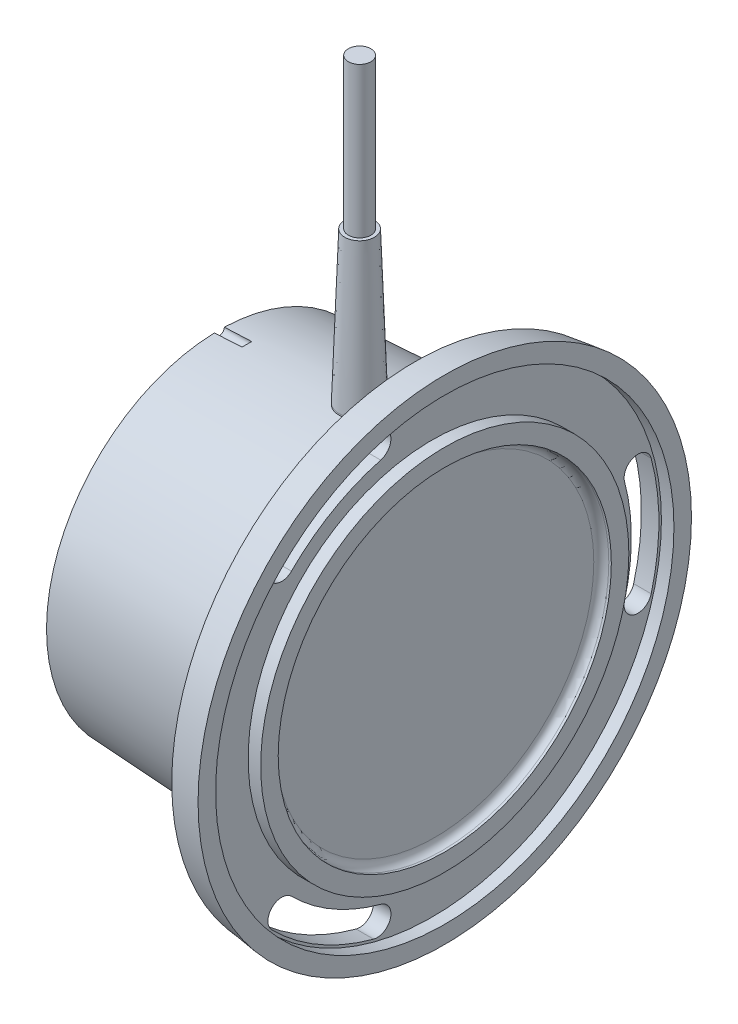
ISO-10303-21;
HEADER;
FILE_DESCRIPTION(('STEP AP214'),'2;1');
FILE_NAME('part.step','',(''),(''),'','','');
FILE_SCHEMA(('AUTOMOTIVE_DESIGN { 1 0 10303 214 1 1 1 1 }'));
ENDSEC;
DATA;
#1=APPLICATION_CONTEXT('core data for automotive mechanical design processes');
#2=APPLICATION_PROTOCOL_DEFINITION('international standard','automotive_design',2000,#1);
#3=PRODUCT_CONTEXT('',#1,'mechanical');
#4=PRODUCT('Part','Part','',(#3));
#5=PRODUCT_RELATED_PRODUCT_CATEGORY('part','',(#4));
#6=PRODUCT_DEFINITION_FORMATION('','',#4);
#7=PRODUCT_DEFINITION_CONTEXT('part definition',#1,'design');
#8=PRODUCT_DEFINITION('design','',#6,#7);
#9=PRODUCT_DEFINITION_SHAPE('','',#8);
#10=(LENGTH_UNIT() NAMED_UNIT(*) SI_UNIT(.MILLI.,.METRE.));
#11=(NAMED_UNIT(*) PLANE_ANGLE_UNIT() SI_UNIT($,.RADIAN.));
#12=(NAMED_UNIT(*) SI_UNIT($,.STERADIAN.) SOLID_ANGLE_UNIT());
#13=UNCERTAINTY_MEASURE_WITH_UNIT(LENGTH_MEASURE(1.E-05),#10,'distance_accuracy_value','');
#14=(GEOMETRIC_REPRESENTATION_CONTEXT(3) GLOBAL_UNCERTAINTY_ASSIGNED_CONTEXT((#13)) GLOBAL_UNIT_ASSIGNED_CONTEXT((#10,
#11,#12)) REPRESENTATION_CONTEXT('',''));
#15=CARTESIAN_POINT('',(0.,0.,0.));
#16=DIRECTION('',(0.,0.,1.));
#17=DIRECTION('',(1.,0.,0.));
#18=AXIS2_PLACEMENT_3D('',#15,#16,#17);
#19=CARTESIAN_POINT('',(28.,66.,0.));
#20=DIRECTION('',(0.,1.,0.));
#21=DIRECTION('',(0.,0.,1.));
#22=AXIS2_PLACEMENT_3D('',#19,#20,#21);
#23=PLANE('',#22);
#24=CARTESIAN_POINT('',(28.,66.,0.));
#25=DIRECTION('',(0.,1.,0.));
#26=DIRECTION('',(0.,0.,1.));
#27=AXIS2_PLACEMENT_3D('',#24,#25,#26);
#28=CIRCLE('',#27,2.95237691524758);
#29=CARTESIAN_POINT('',(28.,66.,2.95237691524758));
#30=VERTEX_POINT('',#29);
#31=EDGE_CURVE('E243',#30,#30,#28,.T.);
#32=ORIENTED_EDGE('',*,*,#31,.T.);
#33=EDGE_LOOP('',(#32));
#34=FACE_BOUND('',#33,.T.);
#35=CARTESIAN_POINT('',(28.,66.,0.));
#36=DIRECTION('',(0.,1.,0.));
#37=DIRECTION('',(0.,0.,1.));
#38=AXIS2_PLACEMENT_3D('',#35,#36,#37);
#39=CIRCLE('',#38,2.25);
#40=CARTESIAN_POINT('',(28.,66.,2.25));
#41=VERTEX_POINT('',#40);
#42=EDGE_CURVE('E237',#41,#41,#39,.T.);
#43=ORIENTED_EDGE('',*,*,#42,.F.);
#44=EDGE_LOOP('',(#43));
#45=FACE_BOUND('',#44,.T.);
#46=ADVANCED_FACE('F33',(#34,#45),#23,.T.);
#47=CARTESIAN_POINT('',(39.,0.,0.));
#48=DIRECTION('',(1.,0.,0.));
#49=DIRECTION('',(0.,0.,-1.));
#50=AXIS2_PLACEMENT_3D('',#47,#48,#49);
#51=CONICAL_SURFACE('',#50,36.5,0.0512371674034185);
#52=CARTESIAN_POINT('',(5.5002,34.7687218096424,-0.963217830515257));
#53=CARTESIAN_POINT('',(5.16734204294178,34.7515126146158,-0.968017715513699));
#54=CARTESIAN_POINT('',(4.83447649524155,34.7343156956424,-0.972319788754847));
#55=CARTESIAN_POINT('',(4.16873657126538,34.6999467406474,-0.979965061656519));
#56=CARTESIAN_POINT('',(3.83586219511793,34.6827747043679,-0.983308271328277));
#57=CARTESIAN_POINT('',(2.91914405483441,34.6355187324375,-0.991245575102052));
#58=CARTESIAN_POINT('',(2.33529050478183,34.6054605980492,-0.994882519406034));
#59=CARTESIAN_POINT('',(1.16755803085788,34.5454209802628,-0.999418047066386));
#60=CARTESIAN_POINT('',(0.583679106717657,34.5154394982784,-1.00031658027601));
#61=CARTESIAN_POINT('',(-0.000199999999913171,34.4854969899679,-0.999894825827186));
#62=B_SPLINE_CURVE_WITH_KNOTS('',3,(#52,#53,#54,#55,#56,#57,#58,#59,#60,#61),.UNSPECIFIED.,.F.,
.F.,(4,2,2,2,4),(0.,1.00001051321694,2.00001058521581,3.75391796812255,5.50785746900228),.UNSPECIFIED.);
#63=CARTESIAN_POINT('',(5.5,34.7687114693804,-0.963220715217156));
#64=VERTEX_POINT('',#63);
#65=CARTESIAN_POINT('',(0.,34.4855072463768,-0.999894974531004));
#66=VERTEX_POINT('',#65);
#67=EDGE_CURVE('E288',#64,#66,#62,.T.);
#68=ORIENTED_EDGE('',*,*,#67,.F.);
#69=CARTESIAN_POINT('',(5.5,0.,0.));
#70=DIRECTION('',(-1.,0.,0.));
#71=DIRECTION('',(0.,0.,1.));
#72=AXIS2_PLACEMENT_3D('',#69,#70,#71);
#73=CIRCLE('',#72,34.7820512820513);
#74=CARTESIAN_POINT('',(5.5,34.7687114693804,0.963220715217156));
#75=VERTEX_POINT('',#74);
#76=EDGE_CURVE('E46',#64,#75,#73,.F.);
#77=ORIENTED_EDGE('',*,*,#76,.T.);
#78=CARTESIAN_POINT('',(-0.000199999999993919,34.4854969899681,0.999894825819203));
#79=CARTESIAN_POINT('',(0.332699120070851,34.502568734654,1.00014192571287));
#80=CARTESIAN_POINT('',(0.665597790263742,34.5196531278215,0.999953259180684));
#81=CARTESIAN_POINT('',(1.33138877954517,34.5538469306266,0.998695719859313));
#82=CARTESIAN_POINT('',(1.66428109866387,34.5709563400077,0.997626856036208));
#83=CARTESIAN_POINT('',(2.58102964638199,34.6181086514903,0.993459361506711));
#84=CARTESIAN_POINT('',(3.16488066336798,34.6481775930621,0.989437990409768));
#85=CARTESIAN_POINT('',(4.33256219321329,34.7083923676219,0.978519800053021));
#86=CARTESIAN_POINT('',(4.91639270551966,34.7385382019746,0.971622929403483));
#87=CARTESIAN_POINT('',(5.5002,34.7687218096424,0.963217830515254));
#88=B_SPLINE_CURVE_WITH_KNOTS('',3,(#78,#79,#80,#81,#82,#83,#84,#85,#86,#87),.UNSPECIFIED.,.F.,
.F.,(4,2,2,2,4),(0.,1.00000943601882,2.00000868562691,3.75391729126552,5.50785724337385),.UNSPECIFIED.);
#89=CARTESIAN_POINT('',(0.,34.4855072463768,0.999894974531034));
#90=VERTEX_POINT('',#89);
#91=EDGE_CURVE('E282',#90,#75,#88,.T.);
#92=ORIENTED_EDGE('',*,*,#91,.F.);
#93=CARTESIAN_POINT('',(0.,0.,0.));
#94=DIRECTION('',(1.,0.,0.));
#95=DIRECTION('',(0.,0.,-1.));
#96=AXIS2_PLACEMENT_3D('',#93,#94,#95);
#97=CIRCLE('',#96,34.5);
#98=EDGE_CURVE('E293',#90,#66,#97,.T.);
#99=ORIENTED_EDGE('',*,*,#98,.T.);
#100=EDGE_LOOP('',(#68,#77,#92,#99));
#101=FACE_BOUND('',#100,.T.);
#102=CARTESIAN_POINT('',(39.,0.,0.));
#103=DIRECTION('',(1.,0.,0.));
#104=DIRECTION('',(0.,0.,-1.));
#105=AXIS2_PLACEMENT_3D('',#102,#103,#104);
#106=CIRCLE('',#105,36.5);
#107=CARTESIAN_POINT('',(39.,0.,-36.5));
#108=VERTEX_POINT('',#107);
#109=EDGE_CURVE('E297',#108,#108,#106,.T.);
#110=ORIENTED_EDGE('',*,*,#109,.F.);
#111=EDGE_LOOP('',(#110));
#112=FACE_BOUND('',#111,.T.);
#113=CARTESIAN_POINT('',(31.0558347950813,36.0002,2.58106057758639));
#114=CARTESIAN_POINT('',(30.9829624943268,35.9902672727489,2.66735260975896));
#115=CARTESIAN_POINT('',(30.9064405762152,35.9800556261139,2.7505215776685));
#116=CARTESIAN_POINT('',(30.7466719839248,35.9592823706909,2.910071888084));
#117=CARTESIAN_POINT('',(30.6634256711525,35.9487207807288,2.98645359491243));
#118=CARTESIAN_POINT('',(30.4908161686985,35.9274594971849,3.13186243648485));
#119=CARTESIAN_POINT('',(30.4014559281775,35.9167598721799,3.20089307663373));
#120=CARTESIAN_POINT('',(30.2172476885548,35.895425998792,3.33114924567909));
#121=CARTESIAN_POINT('',(30.1223997353143,35.8847917498635,3.39237483978921));
#122=CARTESIAN_POINT('',(29.8304853118112,35.8532779428769,3.56372436006317));
#123=CARTESIAN_POINT('',(29.6259738162335,35.8327779406242,3.66158364646448));
#124=CARTESIAN_POINT('',(29.2033293180839,35.7942910934065,3.82139996580729));
#125=CARTESIAN_POINT('',(28.9851998366279,35.7763036026596,3.88336623713577));
#126=CARTESIAN_POINT('',(28.5418974580251,35.7439732599101,3.96952968569834));
#127=CARTESIAN_POINT('',(28.3167443641397,35.7296210465707,3.99382471614747));
#128=CARTESIAN_POINT('',(27.8653088853739,35.7051752926775,4.0041035541207));
#129=CARTESIAN_POINT('',(27.6390263832743,35.6950822038786,3.99008329881642));
#130=CARTESIAN_POINT('',(27.1937070398581,35.6793986955458,3.92430183233382));
#131=CARTESIAN_POINT('',(26.9746267800652,35.6737729780478,3.87284276895653));
#132=CARTESIAN_POINT('',(26.5481313138362,35.6665862830101,3.73394844278099));
#133=CARTESIAN_POINT('',(26.3407152502303,35.6650250064028,3.64651582751784));
#134=CARTESIAN_POINT('',(25.9439509097445,35.6652452000315,3.43841852313303));
#135=CARTESIAN_POINT('',(25.7545590965082,35.6670183890871,3.31783679507882));
#136=CARTESIAN_POINT('',(25.3985907365055,35.672873978875,3.04675615804891));
#137=CARTESIAN_POINT('',(25.2320151157084,35.6769564732933,2.89625603547623));
#138=CARTESIAN_POINT('',(24.9258260511951,35.6862707526889,2.56901438307853));
#139=CARTESIAN_POINT('',(24.7863065502207,35.6915064118599,2.39218506197219));
#140=CARTESIAN_POINT('',(24.5388637024899,35.7019256205789,2.01765029149755));
#141=CARTESIAN_POINT('',(24.4309405336767,35.7071091698332,1.81994472456764));
#142=CARTESIAN_POINT('',(24.2495302789318,35.7163858390452,1.4087535776262));
#143=CARTESIAN_POINT('',(24.1761220668189,35.7204764523041,1.19523313276974));
#144=CARTESIAN_POINT('',(24.0662056397882,35.7267714097324,0.758870392723562));
#145=CARTESIAN_POINT('',(24.0296970657189,35.7289757722609,0.536028188286388));
#146=CARTESIAN_POINT('',(23.9946525520598,35.7310896328418,0.0876713175695218));
#147=CARTESIAN_POINT('',(23.9960651757178,35.7310022394622,-0.137839313980054));
#148=CARTESIAN_POINT('',(24.0366954731665,35.7285562570481,-0.585415220768946));
#149=CARTESIAN_POINT('',(24.0759130712265,35.7261976725632,-0.807480502909052));
#150=CARTESIAN_POINT('',(24.1909846395374,35.7196470954983,-1.24169713964061));
#151=CARTESIAN_POINT('',(24.2668111367126,35.7154564779863,-1.45385579790871));
#152=CARTESIAN_POINT('',(24.4529332365279,35.7060406346837,-1.86244907484916));
#153=CARTESIAN_POINT('',(24.563229324947,35.7008153943125,-2.05888347187091));
#154=CARTESIAN_POINT('',(24.8153872866784,35.690385831593,-2.43080272662581));
#155=CARTESIAN_POINT('',(24.9573011307726,35.6851815582146,-2.60625235301742));
#156=CARTESIAN_POINT('',(25.2685859414863,35.6760073363757,-2.93086060390249));
#157=CARTESIAN_POINT('',(25.4379569820889,35.6720373912412,-3.08001915755263));
#158=CARTESIAN_POINT('',(25.7993482623273,35.6665199941907,-3.34779063006853));
#159=CARTESIAN_POINT('',(25.9913663893216,35.6649723165046,-3.46640639484847));
#160=CARTESIAN_POINT('',(26.3925873816561,35.6653123702629,-3.66971367629691));
#161=CARTESIAN_POINT('',(26.6017896615073,35.6671999847083,-3.75440634819688));
#162=CARTESIAN_POINT('',(27.0305848989475,35.675090549797,-3.8872132736247));
#163=CARTESIAN_POINT('',(27.2501370754722,35.6810784307606,-3.93546011519584));
#164=CARTESIAN_POINT('',(27.6940504208894,35.6974175169125,-3.9945625806928));
#165=CARTESIAN_POINT('',(27.918411434052,35.7077685810053,-4.00541941362367));
#166=CARTESIAN_POINT('',(28.3652462752639,35.7326019704785,-3.98955015371189));
#167=CARTESIAN_POINT('',(28.5877222960208,35.7470785234974,-3.96287636960757));
#168=CARTESIAN_POINT('',(29.0249260272648,35.7794896486706,-3.87289834543561));
#169=CARTESIAN_POINT('',(29.2396520371211,35.7974249743926,-3.80958611687266));
#170=CARTESIAN_POINT('',(29.6566794888091,35.8357789385847,-3.64771004631082));
#171=CARTESIAN_POINT('',(29.8588938676461,35.8562125497036,-3.54892602704241));
#172=CARTESIAN_POINT('',(30.2437568256566,35.8980448599929,-3.31898904684544));
#173=CARTESIAN_POINT('',(30.4264239215302,35.9194426180418,-3.18786711514713));
#174=CARTESIAN_POINT('',(30.6794195624874,35.9507401680791,-2.97196484494406));
#175=CARTESIAN_POINT('',(30.7592031335042,35.9608929454702,-2.89803854800496));
#176=CARTESIAN_POINT('',(30.9123713260509,35.9808478437074,-2.7440570949395));
#177=CARTESIAN_POINT('',(30.9857673404295,35.9906505696851,-2.66401334976948));
#178=CARTESIAN_POINT('',(31.0558347950813,36.0002,-2.58106057758639));
#179=B_SPLINE_CURVE_WITH_KNOTS('',3,(#113,#114,#115,#116,#117,#118,#119,#120,#121,#122,#123,
#124,#125,#126,#127,#128,#129,#130,#131,#132,#133,#134,#135,#136,#137,#138,#139,#140,#141,#142,
#143,#144,#145,#146,#147,#148,#149,#150,#151,#152,#153,#154,#155,#156,#157,#158,#159,#160,#161,
#162,#163,#164,#165,#166,#167,#168,#169,#170,#171,#172,#173,#174,#175,#176,#177,#178),
.UNSPECIFIED.,.F.,.F.,(4,2,2,2,2,2,2,2,2,2,2,2,2,2,2,2,2,2,2,2,2,2,2,2,2,2,2,2,2,2,2,2,4),(0.,
0.34003162992082,0.680044996791593,1.01989549305935,1.3597431495825,2.03914891379344,
2.71837973015977,3.39584323203881,4.07337857273288,4.74550571518656,5.41758340013887,
6.08799417714353,6.75843215395555,7.43115786944948,8.10388737350456,8.77814682022477,
9.45239970417913,10.1257380699741,10.7990750869457,11.4719075830749,12.1447495618427,
12.8187057736358,13.4926638014278,14.1665590084555,14.8404312644169,15.5118400424954,
16.183227110383,16.8536793510486,17.5242778294623,18.1991128535441,18.8733028547369,
19.2007174693075,19.527535597753),.UNSPECIFIED.);
#180=CARTESIAN_POINT('',(31.0543672008937,36.,2.58279712755467));
#181=VERTEX_POINT('',#180);
#182=CARTESIAN_POINT('',(31.0543672008937,36.,-2.58279712755466));
#183=VERTEX_POINT('',#182);
#184=EDGE_CURVE('E11',#181,#183,#179,.T.);
#185=ORIENTED_EDGE('',*,*,#184,.T.);
#186=CARTESIAN_POINT('',(27.9833998795208,35.7105987931147,-4.01007175399731));
#187=CARTESIAN_POINT('',(28.0953593322982,35.7163417419881,-4.01034557312574));
#188=CARTESIAN_POINT('',(28.2072956218739,35.722622268723,-4.00589007800906));
#189=CARTESIAN_POINT('',(28.4303336115921,35.7361774512189,-3.98761805200315));
#190=CARTESIAN_POINT('',(28.5414353689007,35.7434520382186,-3.97380216833122));
#191=CARTESIAN_POINT('',(28.7621470447583,35.7589232142632,-3.93688768197473));
#192=CARTESIAN_POINT('',(28.8717552821482,35.7671207593093,-3.91377938931086));
#193=CARTESIAN_POINT('',(29.0885606636984,35.7843108853839,-3.85848131127856));
#194=CARTESIAN_POINT('',(29.1957578643721,35.7933034477531,-3.82629173901005));
#195=CARTESIAN_POINT('',(29.5151031773822,35.8214937984661,-3.71556629622748));
#196=CARTESIAN_POINT('',(29.7225624403276,35.8417299633842,-3.62328309256945));
#197=CARTESIAN_POINT('',(30.1183253893453,35.8834780301455,-3.40531621497951));
#198=CARTESIAN_POINT('',(30.3066746038733,35.9049866968961,-3.27971463234956));
#199=CARTESIAN_POINT('',(30.550579986323,35.9345126858434,-3.08550409181725));
#200=CARTESIAN_POINT('',(30.6164235052219,35.9426734586635,-3.02949021546776));
#201=CARTESIAN_POINT('',(30.7443732509471,35.9588600471778,-2.9133110074604));
#202=CARTESIAN_POINT('',(30.806478928548,35.9668858429146,-2.85314506848749));
#203=CARTESIAN_POINT('',(31.0225529190029,35.9953280284748,-2.62977390600937));
#204=CARTESIAN_POINT('',(31.1651672955805,36.0151049535421,-2.45518132277018));
#205=CARTESIAN_POINT('',(31.4194607878007,36.0515436737909,-2.08414022516438));
#206=CARTESIAN_POINT('',(31.5310822749109,36.0681996473952,-1.8876519354056));
#207=CARTESIAN_POINT('',(31.7199037465517,36.0969762980213,-1.47849510199219));
#208=CARTESIAN_POINT('',(31.7971143010317,36.1090983675307,-1.26583155039554));
#209=CARTESIAN_POINT('',(31.9147828663527,36.1277684496505,-0.830442611039278));
#210=CARTESIAN_POINT('',(31.9552586501584,36.1343191576925,-0.607722143815681));
#211=CARTESIAN_POINT('',(31.9981272247984,36.1412617648936,-0.16024441226727));
#212=CARTESIAN_POINT('',(32.0008041002316,36.1416996061383,0.0644849419335279));
#213=CARTESIAN_POINT('',(31.9687125848401,36.1364955084141,0.511242061171622));
#214=CARTESIAN_POINT('',(31.933935264284,36.1308521195739,0.733269169180551));
#215=CARTESIAN_POINT('',(31.8281865794448,36.11400123295,1.16744924563032));
#216=CARTESIAN_POINT('',(31.7573416441814,36.1028131746953,1.37963389925846));
#217=CARTESIAN_POINT('',(31.5816049320715,36.0758210941605,1.78897675305125));
#218=CARTESIAN_POINT('',(31.4767415814421,36.0600209269177,1.98614732990756));
#219=CARTESIAN_POINT('',(31.2851446796524,36.0322283828409,2.28391600427189));
#220=CARTESIAN_POINT('',(31.2083789655692,36.0213003064571,2.39118065140094));
#221=CARTESIAN_POINT('',(31.044791062201,35.9985998299687,2.59748113137976));
#222=CARTESIAN_POINT('',(30.9579846030626,35.9868287612532,2.69652942910811));
#223=CARTESIAN_POINT('',(30.8552850195916,35.9733102751546,2.80268989488496));
#224=CARTESIAN_POINT('',(30.8438974364009,35.9718165978068,2.81431833163313));
#225=CARTESIAN_POINT('',(30.7533387548289,35.959981387428,2.90567114175496));
#226=CARTESIAN_POINT('',(30.6708540912116,35.9494597531091,2.98216037740806));
#227=CARTESIAN_POINT('',(30.4997181627153,35.9282585005333,3.12795611742919));
#228=CARTESIAN_POINT('',(30.4110626214788,35.9175787768396,3.19725755621997));
#229=CARTESIAN_POINT('',(30.2279433349405,35.896236574523,3.3283606891612));
#230=CARTESIAN_POINT('',(30.1334626473711,35.8855742486596,3.39013878623833));
#231=CARTESIAN_POINT('',(29.9395996722736,35.8644995245834,3.50550341518781));
#232=CARTESIAN_POINT('',(29.8402173171037,35.8540871298225,3.55908983397511));
#233=CARTESIAN_POINT('',(29.6369377729765,35.8336695214189,3.65783277381456));
#234=CARTESIAN_POINT('',(29.5330279893266,35.8236656163996,3.70296364649488));
#235=CARTESIAN_POINT('',(29.3216974973321,35.8042706022348,3.78426516425104));
#236=CARTESIAN_POINT('',(29.2142765882966,35.7948795282102,3.820435296126));
#237=CARTESIAN_POINT('',(28.9969139009702,35.776884053955,3.88346825080975));
#238=CARTESIAN_POINT('',(28.8869777566887,35.768278076773,3.91035004733506));
#239=CARTESIAN_POINT('',(28.6651563340408,35.7519534316611,3.95471337374277));
#240=CARTESIAN_POINT('',(28.5532709809385,35.74423479784,3.97219454236664));
#241=CARTESIAN_POINT('',(28.4408073115007,35.737021322801,3.98487648383626));
#242=B_SPLINE_CURVE_WITH_KNOTS('',3,(#186,#187,#188,#189,#190,#191,#192,#193,#194,#195,#196,
#197,#198,#199,#200,#201,#202,#203,#204,#205,#206,#207,#208,#209,#210,#211,#212,#213,#214,#215,
#216,#217,#218,#219,#220,#221,#222,#223,#224,#225,#226,#227,#228,#229,#230,#231,#232,#233,#234,
#235,#236,#237,#238,#239,#240,#241),.UNSPECIFIED.,.F.,.F.,(4,2,2,2,2,2,2,2,2,2,2,2,2,2,2,2,2,2,
2,2,2,2,2,2,2,2,2,4),(0.,0.336208997956096,0.672394751356191,1.00893198690024,1.34546132596945,
2.02587329334808,2.70462415629729,2.96497117405067,3.22535635335817,3.90075290128563,
4.57739700515867,5.25383312188312,5.92994179150871,6.60096631494232,7.27215085771425,
7.94099870970565,8.60928909743015,9.00582244728399,9.40174278134973,9.45077628912493,
9.78926013305689,10.1279809242984,10.46773815601,10.807500077602,11.1482764859738,
11.4890724068331,11.8291679941681,12.1692766501681),.UNSPECIFIED.);
#243=EDGE_CURVE('E246',#183,#181,#242,.T.);
#244=ORIENTED_EDGE('',*,*,#243,.T.);
#245=EDGE_LOOP('',(#185,#244));
#246=FACE_BOUND('',#245,.T.);
#247=ADVANCED_FACE('F255',(#101,#112,#246),#51,.T.);
#248=CARTESIAN_POINT('',(43.,31.75,0.));
#249=DIRECTION('',(1.,0.,0.));
#250=DIRECTION('',(0.,0.,-1.));
#251=AXIS2_PLACEMENT_3D('',#248,#249,#250);
#252=PLANE('',#251);
#253=CARTESIAN_POINT('',(43.,0.,0.));
#254=DIRECTION('',(1.,0.,0.));
#255=DIRECTION('',(0.,0.,-1.));
#256=AXIS2_PLACEMENT_3D('',#253,#254,#255);
#257=CIRCLE('',#256,31.75);
#258=CARTESIAN_POINT('',(43.,0.,-31.75));
#259=VERTEX_POINT('',#258);
#260=EDGE_CURVE('E324',#259,#259,#257,.T.);
#261=ORIENTED_EDGE('',*,*,#260,.T.);
#262=EDGE_LOOP('',(#261));
#263=FACE_BOUND('',#262,.T.);
#264=ADVANCED_FACE('F35',(#263),#252,.T.);
#265=CARTESIAN_POINT('',(44.5,0.,0.));
#266=DIRECTION('',(1.,0.,0.));
#267=DIRECTION('',(0.,0.,-1.));
#268=AXIS2_PLACEMENT_3D('',#265,#266,#267);
#269=TOROIDAL_SURFACE('',#268,31.75,1.5);
#270=CARTESIAN_POINT('',(44.5,0.,0.));
#271=DIRECTION('',(1.,0.,0.));
#272=DIRECTION('',(0.,0.,-1.));
#273=AXIS2_PLACEMENT_3D('',#270,#271,#272);
#274=CIRCLE('',#273,33.25);
#275=CARTESIAN_POINT('',(44.5,0.,-33.25));
#276=VERTEX_POINT('',#275);
#277=EDGE_CURVE('E321',#276,#276,#274,.T.);
#278=ORIENTED_EDGE('',*,*,#277,.T.);
#279=EDGE_LOOP('',(#278));
#280=FACE_BOUND('',#279,.T.);
#281=ORIENTED_EDGE('',*,*,#260,.F.);
#282=EDGE_LOOP('',(#281));
#283=FACE_BOUND('',#282,.T.);
#284=ADVANCED_FACE('F347',(#280,#283),#269,.F.);
#285=CARTESIAN_POINT('',(104.922362869198,0.,0.));
#286=DIRECTION('',(1.,0.,0.));
#287=DIRECTION('',(0.,0.,-1.));
#288=AXIS2_PLACEMENT_3D('',#285,#286,#287);
#289=CYLINDRICAL_SURFACE('',#288,33.25);
#290=CARTESIAN_POINT('',(45.,0.,0.));
#291=DIRECTION('',(1.,0.,0.));
#292=DIRECTION('',(0.,0.,-1.));
#293=AXIS2_PLACEMENT_3D('',#290,#291,#292);
#294=CIRCLE('',#293,33.25);
#295=CARTESIAN_POINT('',(45.,0.,-33.25));
#296=VERTEX_POINT('',#295);
#297=EDGE_CURVE('E318',#296,#296,#294,.T.);
#298=ORIENTED_EDGE('',*,*,#297,.T.);
#299=EDGE_LOOP('',(#298));
#300=FACE_BOUND('',#299,.T.);
#301=ORIENTED_EDGE('',*,*,#277,.F.);
#302=EDGE_LOOP('',(#301));
#303=FACE_BOUND('',#302,.T.);
#304=ADVANCED_FACE('F440',(#300,#303),#289,.F.);
#305=CARTESIAN_POINT('',(45.,36.75,0.));
#306=DIRECTION('',(1.,0.,0.));
#307=DIRECTION('',(0.,0.,-1.));
#308=AXIS2_PLACEMENT_3D('',#305,#306,#307);
#309=PLANE('',#308);
#310=CARTESIAN_POINT('',(45.,0.,0.));
#311=DIRECTION('',(1.,0.,0.));
#312=DIRECTION('',(0.,0.,-1.));
#313=AXIS2_PLACEMENT_3D('',#310,#311,#312);
#314=CIRCLE('',#313,36.75);
#315=CARTESIAN_POINT('',(45.,0.,-36.75));
#316=VERTEX_POINT('',#315);
#317=EDGE_CURVE('E315',#316,#316,#314,.T.);
#318=ORIENTED_EDGE('',*,*,#317,.T.);
#319=EDGE_LOOP('',(#318));
#320=FACE_BOUND('',#319,.T.);
#321=ORIENTED_EDGE('',*,*,#297,.F.);
#322=EDGE_LOOP('',(#321));
#323=FACE_BOUND('',#322,.T.);
#324=ADVANCED_FACE('F434',(#320,#323),#309,.T.);
#325=CARTESIAN_POINT('',(104.922362869198,0.,0.));
#326=DIRECTION('',(1.,0.,0.));
#327=DIRECTION('',(0.,0.,-1.));
#328=AXIS2_PLACEMENT_3D('',#325,#326,#327);
#329=CYLINDRICAL_SURFACE('',#328,36.75);
#330=CARTESIAN_POINT('',(42.5,0.,0.));
#331=DIRECTION('',(1.,0.,0.));
#332=DIRECTION('',(0.,0.,-1.));
#333=AXIS2_PLACEMENT_3D('',#330,#331,#332);
#334=CIRCLE('',#333,36.75);
#335=CARTESIAN_POINT('',(42.5,0.,-36.75));
#336=VERTEX_POINT('',#335);
#337=EDGE_CURVE('E312',#336,#336,#334,.T.);
#338=ORIENTED_EDGE('',*,*,#337,.T.);
#339=EDGE_LOOP('',(#338));
#340=FACE_BOUND('',#339,.T.);
#341=ORIENTED_EDGE('',*,*,#317,.F.);
#342=EDGE_LOOP('',(#341));
#343=FACE_BOUND('',#342,.T.);
#344=ADVANCED_FACE('F418',(#340,#343),#329,.T.);
#345=CARTESIAN_POINT('',(42.5,45.75,0.));
#346=DIRECTION('',(1.,0.,0.));
#347=DIRECTION('',(0.,0.,-1.));
#348=AXIS2_PLACEMENT_3D('',#345,#346,#347);
#349=PLANE('',#348);
#350=CARTESIAN_POINT('',(42.5,0.,0.));
#351=DIRECTION('',(1.,0.,0.));
#352=DIRECTION('',(0.,0.,-1.));
#353=AXIS2_PLACEMENT_3D('',#350,#351,#352);
#354=CIRCLE('',#353,45.25);
#355=CARTESIAN_POINT('',(42.5,43.7081980100518,11.711358875643));
#356=VERTEX_POINT('',#355);
#357=CARTESIAN_POINT('',(42.5,31.9964333041697,31.9967303925233));
#358=VERTEX_POINT('',#357);
#359=EDGE_CURVE('E177',#356,#358,#354,.T.);
#360=ORIENTED_EDGE('',*,*,#359,.F.);
#361=CARTESIAN_POINT('',(42.5,41.0518986834741,10.9996188334768));
#362=DIRECTION('',(1.,0.,0.));
#363=DIRECTION('',(0.,0.,-1.));
#364=AXIS2_PLACEMENT_3D('',#361,#362,#363);
#365=CIRCLE('',#364,2.74999999999999);
#366=CARTESIAN_POINT('',(42.5,38.3955993568964,10.2878787913107));
#367=VERTEX_POINT('',#366);
#368=EDGE_CURVE('E170',#367,#356,#365,.T.);
#369=ORIENTED_EDGE('',*,*,#368,.F.);
#370=CARTESIAN_POINT('',(42.5,0.,0.));
#371=DIRECTION('',(1.,0.,0.));
#372=DIRECTION('',(0.,0.,-1.));
#373=AXIS2_PLACEMENT_3D('',#370,#371,#372);
#374=CIRCLE('',#373,39.75);
#375=CARTESIAN_POINT('',(42.5,28.1073640627789,28.1076250409459));
#376=VERTEX_POINT('',#375);
#377=EDGE_CURVE('E150',#376,#367,#374,.F.);
#378=ORIENTED_EDGE('',*,*,#377,.F.);
#379=CARTESIAN_POINT('',(42.5,30.0518986834743,30.0521777167346));
#380=DIRECTION('',(1.,0.,0.));
#381=DIRECTION('',(0.,0.,-1.));
#382=AXIS2_PLACEMENT_3D('',#379,#380,#381);
#383=CIRCLE('',#382,2.74999999999999);
#384=EDGE_CURVE('E175',#358,#376,#383,.T.);
#385=ORIENTED_EDGE('',*,*,#384,.F.);
#386=EDGE_LOOP('',(#360,#369,#378,#385));
#387=FACE_BOUND('',#386,.T.);
#388=CARTESIAN_POINT('',(42.5,0.,0.));
#389=DIRECTION('',(1.,0.,0.));
#390=DIRECTION('',(0.,0.,-1.));
#391=AXIS2_PLACEMENT_3D('',#388,#389,#390);
#392=CIRCLE('',#391,45.25);
#393=CARTESIAN_POINT('',(42.5,-31.9964333041692,31.9967303925237));
#394=VERTEX_POINT('',#393);
#395=CARTESIAN_POINT('',(42.5,-43.7081980100517,11.7113588756436));
#396=VERTEX_POINT('',#395);
#397=EDGE_CURVE('E206',#394,#396,#392,.T.);
#398=ORIENTED_EDGE('',*,*,#397,.F.);
#399=CARTESIAN_POINT('',(42.5,-30.0518986834739,30.052177716735));
#400=DIRECTION('',(1.,0.,0.));
#401=DIRECTION('',(0.,0.,-1.));
#402=AXIS2_PLACEMENT_3D('',#399,#400,#401);
#403=CIRCLE('',#402,2.74999999999999);
#404=CARTESIAN_POINT('',(42.5,-28.1073640627785,28.1076250409463));
#405=VERTEX_POINT('',#404);
#406=EDGE_CURVE('E193',#405,#394,#403,.T.);
#407=ORIENTED_EDGE('',*,*,#406,.F.);
#408=CARTESIAN_POINT('',(42.5,0.,0.));
#409=DIRECTION('',(1.,0.,0.));
#410=DIRECTION('',(0.,0.,-1.));
#411=AXIS2_PLACEMENT_3D('',#408,#409,#410);
#412=CIRCLE('',#411,39.75);
#413=CARTESIAN_POINT('',(42.5,-38.3955993568962,10.2878787913112));
#414=VERTEX_POINT('',#413);
#415=EDGE_CURVE('E201',#414,#405,#412,.F.);
#416=ORIENTED_EDGE('',*,*,#415,.F.);
#417=CARTESIAN_POINT('',(42.5,-41.051898683474,10.9996188334774));
#418=DIRECTION('',(1.,0.,0.));
#419=DIRECTION('',(0.,0.,-1.));
#420=AXIS2_PLACEMENT_3D('',#417,#418,#419);
#421=CIRCLE('',#420,2.74999999999999);
#422=EDGE_CURVE('E204',#396,#414,#421,.T.);
#423=ORIENTED_EDGE('',*,*,#422,.F.);
#424=EDGE_LOOP('',(#398,#407,#416,#423));
#425=FACE_BOUND('',#424,.T.);
#426=CARTESIAN_POINT('',(42.5,0.,0.));
#427=DIRECTION('',(1.,0.,0.));
#428=DIRECTION('',(0.,0.,-1.));
#429=AXIS2_PLACEMENT_3D('',#426,#427,#428);
#430=CIRCLE('',#429,45.25);
#431=CARTESIAN_POINT('',(42.5,-11.7117647058824,-43.7080892681669));
#432=VERTEX_POINT('',#431);
#433=CARTESIAN_POINT('',(42.5,11.7117647058823,-43.7080892681669));
#434=VERTEX_POINT('',#433);
#435=EDGE_CURVE('E235',#432,#434,#430,.T.);
#436=ORIENTED_EDGE('',*,*,#435,.F.);
#437=CARTESIAN_POINT('',(42.5,-11.,-41.051796550212));
#438=DIRECTION('',(1.,0.,0.));
#439=DIRECTION('',(0.,0.,-1.));
#440=AXIS2_PLACEMENT_3D('',#437,#438,#439);
#441=CIRCLE('',#440,2.74999999999999);
#442=CARTESIAN_POINT('',(42.5,-10.2882352941177,-38.3955038322571));
#443=VERTEX_POINT('',#442);
#444=EDGE_CURVE('E222',#443,#432,#441,.T.);
#445=ORIENTED_EDGE('',*,*,#444,.F.);
#446=CARTESIAN_POINT('',(42.5,0.,0.));
#447=DIRECTION('',(1.,0.,0.));
#448=DIRECTION('',(0.,0.,-1.));
#449=AXIS2_PLACEMENT_3D('',#446,#447,#448);
#450=CIRCLE('',#449,39.75);
#451=CARTESIAN_POINT('',(42.5,10.2882352941176,-38.3955038322571));
#452=VERTEX_POINT('',#451);
#453=EDGE_CURVE('E230',#452,#443,#450,.F.);
#454=ORIENTED_EDGE('',*,*,#453,.F.);
#455=CARTESIAN_POINT('',(42.5,11.,-41.051796550212));
#456=DIRECTION('',(1.,0.,0.));
#457=DIRECTION('',(0.,0.,-1.));
#458=AXIS2_PLACEMENT_3D('',#455,#456,#457);
#459=CIRCLE('',#458,2.74999999999999);
#460=EDGE_CURVE('E233',#434,#452,#459,.T.);
#461=ORIENTED_EDGE('',*,*,#460,.F.);
#462=EDGE_LOOP('',(#436,#445,#454,#461));
#463=FACE_BOUND('',#462,.T.);
#464=CARTESIAN_POINT('',(42.5,0.,0.));
#465=DIRECTION('',(1.,0.,0.));
#466=DIRECTION('',(0.,0.,-1.));
#467=AXIS2_PLACEMENT_3D('',#464,#465,#466);
#468=CIRCLE('',#467,45.75);
#469=CARTESIAN_POINT('',(42.5,0.,-45.75));
#470=VERTEX_POINT('',#469);
#471=EDGE_CURVE('E309',#470,#470,#468,.T.);
#472=ORIENTED_EDGE('',*,*,#471,.T.);
#473=EDGE_LOOP('',(#472));
#474=FACE_BOUND('',#473,.T.);
#475=ORIENTED_EDGE('',*,*,#337,.F.);
#476=EDGE_LOOP('',(#475));
#477=FACE_BOUND('',#476,.T.);
#478=ADVANCED_FACE('F414',(#387,#425,#463,#474,#477),#349,.T.);
#479=CARTESIAN_POINT('',(104.922362869198,0.,0.));
#480=DIRECTION('',(1.,0.,0.));
#481=DIRECTION('',(0.,0.,-1.));
#482=AXIS2_PLACEMENT_3D('',#479,#480,#481);
#483=CYLINDRICAL_SURFACE('',#482,45.75);
#484=CARTESIAN_POINT('',(45.,0.,0.));
#485=DIRECTION('',(1.,0.,0.));
#486=DIRECTION('',(0.,0.,-1.));
#487=AXIS2_PLACEMENT_3D('',#484,#485,#486);
#488=CIRCLE('',#487,45.75);
#489=CARTESIAN_POINT('',(45.,0.,-45.75));
#490=VERTEX_POINT('',#489);
#491=EDGE_CURVE('E306',#490,#490,#488,.T.);
#492=ORIENTED_EDGE('',*,*,#491,.T.);
#493=EDGE_LOOP('',(#492));
#494=FACE_BOUND('',#493,.T.);
#495=ORIENTED_EDGE('',*,*,#471,.F.);
#496=EDGE_LOOP('',(#495));
#497=FACE_BOUND('',#496,.T.);
#498=ADVANCED_FACE('F417',(#494,#497),#483,.F.);
#499=CARTESIAN_POINT('',(45.,49.25,0.));
#500=DIRECTION('',(1.,0.,0.));
#501=DIRECTION('',(0.,0.,-1.));
#502=AXIS2_PLACEMENT_3D('',#499,#500,#501);
#503=PLANE('',#502);
#504=CARTESIAN_POINT('',(45.,0.,0.));
#505=DIRECTION('',(1.,0.,0.));
#506=DIRECTION('',(0.,0.,-1.));
#507=AXIS2_PLACEMENT_3D('',#504,#505,#506);
#508=CIRCLE('',#507,49.25);
#509=CARTESIAN_POINT('',(45.,0.,-49.25));
#510=VERTEX_POINT('',#509);
#511=EDGE_CURVE('E303',#510,#510,#508,.T.);
#512=ORIENTED_EDGE('',*,*,#511,.T.);
#513=EDGE_LOOP('',(#512));
#514=FACE_BOUND('',#513,.T.);
#515=ORIENTED_EDGE('',*,*,#491,.F.);
#516=EDGE_LOOP('',(#515));
#517=FACE_BOUND('',#516,.T.);
#518=ADVANCED_FACE('F457',(#514,#517),#503,.T.);
#519=CARTESIAN_POINT('',(45.,0.,0.));
#520=DIRECTION('',(1.,0.,0.));
#521=DIRECTION('',(0.,0.,-1.));
#522=AXIS2_PLACEMENT_3D('',#519,#520,#521);
#523=CONICAL_SURFACE('',#522,49.25,0.124354994546762);
#524=CARTESIAN_POINT('',(39.,0.,0.));
#525=DIRECTION('',(1.,0.,0.));
#526=DIRECTION('',(0.,0.,-1.));
#527=AXIS2_PLACEMENT_3D('',#524,#525,#526);
#528=CIRCLE('',#527,48.5);
#529=CARTESIAN_POINT('',(39.,0.,-48.5));
#530=VERTEX_POINT('',#529);
#531=EDGE_CURVE('E300',#530,#530,#528,.T.);
#532=ORIENTED_EDGE('',*,*,#531,.T.);
#533=EDGE_LOOP('',(#532));
#534=FACE_BOUND('',#533,.T.);
#535=ORIENTED_EDGE('',*,*,#511,.F.);
#536=EDGE_LOOP('',(#535));
#537=FACE_BOUND('',#536,.T.);
#538=ADVANCED_FACE('F461',(#534,#537),#523,.T.);
#539=CARTESIAN_POINT('',(39.,36.5,0.));
#540=DIRECTION('',(-1.,0.,0.));
#541=DIRECTION('',(0.,0.,1.));
#542=AXIS2_PLACEMENT_3D('',#539,#540,#541);
#543=PLANE('',#542);
#544=CARTESIAN_POINT('',(39.,0.,0.));
#545=DIRECTION('',(-1.,0.,0.));
#546=DIRECTION('',(0.,-0.866025403784443,-0.499999999999992));
#547=AXIS2_PLACEMENT_3D('',#544,#545,#546);
#548=CIRCLE('',#547,45.25);
#549=CARTESIAN_POINT('',(39.,31.9964333041697,31.9967303925233));
#550=VERTEX_POINT('',#549);
#551=CARTESIAN_POINT('',(39.,43.7081980100518,11.711358875643));
#552=VERTEX_POINT('',#551);
#553=EDGE_CURVE('E61',#550,#552,#548,.T.);
#554=ORIENTED_EDGE('',*,*,#553,.F.);
#555=CARTESIAN_POINT('',(39.,30.0518986834743,30.0521777167346));
#556=DIRECTION('',(-1.,0.,0.));
#557=DIRECTION('',(0.,-0.866025403784443,-0.499999999999992));
#558=AXIS2_PLACEMENT_3D('',#555,#556,#557);
#559=CIRCLE('',#558,2.74999999999999);
#560=CARTESIAN_POINT('',(39.,28.1073640627789,28.1076250409459));
#561=VERTEX_POINT('',#560);
#562=EDGE_CURVE('E163',#561,#550,#559,.T.);
#563=ORIENTED_EDGE('',*,*,#562,.F.);
#564=CARTESIAN_POINT('',(39.,0.,0.));
#565=DIRECTION('',(1.,0.,0.));
#566=DIRECTION('',(0.,-0.866025403784443,-0.499999999999992));
#567=AXIS2_PLACEMENT_3D('',#564,#565,#566);
#568=CIRCLE('',#567,39.75);
#569=CARTESIAN_POINT('',(39.,38.3955993568964,10.2878787913107));
#570=VERTEX_POINT('',#569);
#571=EDGE_CURVE('E147',#570,#561,#568,.T.);
#572=ORIENTED_EDGE('',*,*,#571,.F.);
#573=CARTESIAN_POINT('',(39.,41.0518986834741,10.9996188334768));
#574=DIRECTION('',(-1.,0.,0.));
#575=DIRECTION('',(0.,0.866025403784443,0.499999999999992));
#576=AXIS2_PLACEMENT_3D('',#573,#574,#575);
#577=CIRCLE('',#576,2.74999999999999);
#578=EDGE_CURVE('E156',#552,#570,#577,.T.);
#579=ORIENTED_EDGE('',*,*,#578,.F.);
#580=EDGE_LOOP('',(#554,#563,#572,#579));
#581=FACE_BOUND('',#580,.T.);
#582=CARTESIAN_POINT('',(39.,0.,0.));
#583=DIRECTION('',(-1.,0.,0.));
#584=DIRECTION('',(0.,0.866025403784436,-0.500000000000004));
#585=AXIS2_PLACEMENT_3D('',#582,#583,#584);
#586=CIRCLE('',#585,45.25);
#587=CARTESIAN_POINT('',(39.,-43.7081980100517,11.7113588756436));
#588=VERTEX_POINT('',#587);
#589=CARTESIAN_POINT('',(39.,-31.9964333041692,31.9967303925237));
#590=VERTEX_POINT('',#589);
#591=EDGE_CURVE('E179',#588,#590,#586,.T.);
#592=ORIENTED_EDGE('',*,*,#591,.F.);
#593=CARTESIAN_POINT('',(39.,-41.051898683474,10.9996188334774));
#594=DIRECTION('',(-1.,0.,0.));
#595=DIRECTION('',(0.,0.866025403784436,-0.500000000000004));
#596=AXIS2_PLACEMENT_3D('',#593,#594,#595);
#597=CIRCLE('',#596,2.74999999999999);
#598=CARTESIAN_POINT('',(39.,-38.3955993568962,10.2878787913112));
#599=VERTEX_POINT('',#598);
#600=EDGE_CURVE('E187',#599,#588,#597,.T.);
#601=ORIENTED_EDGE('',*,*,#600,.F.);
#602=CARTESIAN_POINT('',(39.,0.,0.));
#603=DIRECTION('',(1.,0.,0.));
#604=DIRECTION('',(0.,0.866025403784436,-0.500000000000004));
#605=AXIS2_PLACEMENT_3D('',#602,#603,#604);
#606=CIRCLE('',#605,39.75);
#607=CARTESIAN_POINT('',(39.,-28.1073640627785,28.1076250409463));
#608=VERTEX_POINT('',#607);
#609=EDGE_CURVE('E184',#608,#599,#606,.T.);
#610=ORIENTED_EDGE('',*,*,#609,.F.);
#611=CARTESIAN_POINT('',(39.,-30.0518986834739,30.052177716735));
#612=DIRECTION('',(-1.,0.,0.));
#613=DIRECTION('',(0.,-0.866025403784436,0.500000000000004));
#614=AXIS2_PLACEMENT_3D('',#611,#612,#613);
#615=CIRCLE('',#614,2.74999999999999);
#616=EDGE_CURVE('E181',#590,#608,#615,.T.);
#617=ORIENTED_EDGE('',*,*,#616,.F.);
#618=EDGE_LOOP('',(#592,#601,#610,#617));
#619=FACE_BOUND('',#618,.T.);
#620=CARTESIAN_POINT('',(39.,0.,0.));
#621=DIRECTION('',(-1.,0.,0.));
#622=DIRECTION('',(0.,0.,1.));
#623=AXIS2_PLACEMENT_3D('',#620,#621,#622);
#624=CIRCLE('',#623,45.25);
#625=CARTESIAN_POINT('',(39.,11.7117647058823,-43.7080892681669));
#626=VERTEX_POINT('',#625);
#627=CARTESIAN_POINT('',(39.,-11.7117647058824,-43.7080892681669));
#628=VERTEX_POINT('',#627);
#629=EDGE_CURVE('E208',#626,#628,#624,.T.);
#630=ORIENTED_EDGE('',*,*,#629,.F.);
#631=CARTESIAN_POINT('',(39.,11.,-41.051796550212));
#632=DIRECTION('',(-1.,0.,0.));
#633=DIRECTION('',(0.,0.,1.));
#634=AXIS2_PLACEMENT_3D('',#631,#632,#633);
#635=CIRCLE('',#634,2.74999999999999);
#636=CARTESIAN_POINT('',(39.,10.2882352941176,-38.3955038322571));
#637=VERTEX_POINT('',#636);
#638=EDGE_CURVE('E216',#637,#626,#635,.T.);
#639=ORIENTED_EDGE('',*,*,#638,.F.);
#640=CARTESIAN_POINT('',(39.,0.,0.));
#641=DIRECTION('',(1.,0.,0.));
#642=DIRECTION('',(0.,0.,1.));
#643=AXIS2_PLACEMENT_3D('',#640,#641,#642);
#644=CIRCLE('',#643,39.75);
#645=CARTESIAN_POINT('',(39.,-10.2882352941177,-38.3955038322571));
#646=VERTEX_POINT('',#645);
#647=EDGE_CURVE('E213',#646,#637,#644,.T.);
#648=ORIENTED_EDGE('',*,*,#647,.F.);
#649=CARTESIAN_POINT('',(39.,-11.,-41.051796550212));
#650=DIRECTION('',(-1.,0.,0.));
#651=DIRECTION('',(0.,0.,-1.));
#652=AXIS2_PLACEMENT_3D('',#649,#650,#651);
#653=CIRCLE('',#652,2.74999999999999);
#654=EDGE_CURVE('E210',#628,#646,#653,.T.);
#655=ORIENTED_EDGE('',*,*,#654,.F.);
#656=EDGE_LOOP('',(#630,#639,#648,#655));
#657=FACE_BOUND('',#656,.T.);
#658=ORIENTED_EDGE('',*,*,#109,.T.);
#659=EDGE_LOOP('',(#658));
#660=FACE_BOUND('',#659,.T.);
#661=ORIENTED_EDGE('',*,*,#531,.F.);
#662=EDGE_LOOP('',(#661));
#663=FACE_BOUND('',#662,.T.);
#664=ADVANCED_FACE('F160',(#581,#619,#657,#660,#663),#543,.T.);
#665=CARTESIAN_POINT('',(0.,0.,0.));
#666=DIRECTION('',(-1.,0.,0.));
#667=DIRECTION('',(0.,0.,1.));
#668=AXIS2_PLACEMENT_3D('',#665,#666,#667);
#669=PLANE('',#668);
#670=CARTESIAN_POINT('',(0.,34.5,0.));
#671=DIRECTION('',(-1.,0.,0.));
#672=DIRECTION('',(0.,0.,1.));
#673=AXIS2_PLACEMENT_3D('',#670,#671,#672);
#674=CIRCLE('',#673,1.);
#675=EDGE_CURVE('E336',#66,#90,#674,.T.);
#676=ORIENTED_EDGE('',*,*,#675,.F.);
#677=ORIENTED_EDGE('',*,*,#98,.F.);
#678=EDGE_LOOP('',(#676,#677));
#679=FACE_BOUND('',#678,.T.);
#680=ADVANCED_FACE('F278',(#679),#669,.T.);
#681=CARTESIAN_POINT('',(5.5,34.5,0.));
#682=DIRECTION('',(-1.,0.,0.));
#683=DIRECTION('',(0.,0.,1.));
#684=AXIS2_PLACEMENT_3D('',#681,#682,#683);
#685=CYLINDRICAL_SURFACE('',#684,1.);
#686=ORIENTED_EDGE('',*,*,#67,.T.);
#687=ORIENTED_EDGE('',*,*,#675,.T.);
#688=ORIENTED_EDGE('',*,*,#91,.T.);
#689=CARTESIAN_POINT('',(5.5,34.5,0.));
#690=DIRECTION('',(-1.,0.,0.));
#691=DIRECTION('',(0.,0.,1.));
#692=AXIS2_PLACEMENT_3D('',#689,#690,#691);
#693=CIRCLE('',#692,1.);
#694=EDGE_CURVE('E334',#64,#75,#693,.T.);
#695=ORIENTED_EDGE('',*,*,#694,.F.);
#696=EDGE_LOOP('',(#686,#687,#688,#695));
#697=FACE_BOUND('',#696,.T.);
#698=ADVANCED_FACE('F274',(#697),#685,.F.);
#699=CARTESIAN_POINT('',(5.5,34.5,0.));
#700=DIRECTION('',(-1.,0.,0.));
#701=DIRECTION('',(0.,0.,1.));
#702=AXIS2_PLACEMENT_3D('',#699,#700,#701);
#703=PLANE('',#702);
#704=ORIENTED_EDGE('',*,*,#694,.T.);
#705=ORIENTED_EDGE('',*,*,#76,.F.);
#706=EDGE_LOOP('',(#704,#705));
#707=FACE_BOUND('',#706,.T.);
#708=ADVANCED_FACE('F270',(#707),#703,.T.);
#709=CARTESIAN_POINT('',(28.,36.,0.));
#710=DIRECTION('',(0.,-1.,0.));
#711=DIRECTION('',(0.,0.,-1.));
#712=AXIS2_PLACEMENT_3D('',#709,#710,#711);
#713=CYLINDRICAL_SURFACE('',#712,4.00000000000001);
#714=ORIENTED_EDGE('',*,*,#184,.F.);
#715=CARTESIAN_POINT('',(28.,36.,0.));
#716=DIRECTION('',(0.,1.,0.));
#717=DIRECTION('',(0.,0.,1.));
#718=AXIS2_PLACEMENT_3D('',#715,#716,#717);
#719=CIRCLE('',#718,4.00000000000001);
#720=EDGE_CURVE('E253',#183,#181,#719,.T.);
#721=ORIENTED_EDGE('',*,*,#720,.F.);
#722=EDGE_LOOP('',(#714,#721));
#723=FACE_BOUND('',#722,.T.);
#724=ADVANCED_FACE('F264',(#723),#713,.T.);
#725=CARTESIAN_POINT('',(28.,36.,0.));
#726=DIRECTION('',(0.,-1.,0.));
#727=DIRECTION('',(0.,0.,1.));
#728=AXIS2_PLACEMENT_3D('',#725,#726,#727);
#729=CONICAL_SURFACE('',#728,4.00000000000001,0.0349065850398867);
#730=ORIENTED_EDGE('',*,*,#243,.F.);
#731=ORIENTED_EDGE('',*,*,#720,.T.);
#732=EDGE_LOOP('',(#730,#731));
#733=FACE_BOUND('',#732,.T.);
#734=ORIENTED_EDGE('',*,*,#31,.F.);
#735=EDGE_LOOP('',(#734));
#736=FACE_BOUND('',#735,.T.);
#737=ADVANCED_FACE('F259',(#733,#736),#729,.T.);
#738=CARTESIAN_POINT('',(28.,96.,0.));
#739=DIRECTION('',(0.,-1.,0.));
#740=DIRECTION('',(0.,0.,-1.));
#741=AXIS2_PLACEMENT_3D('',#738,#739,#740);
#742=CYLINDRICAL_SURFACE('',#741,2.25);
#743=CARTESIAN_POINT('',(28.,96.,0.));
#744=DIRECTION('',(0.,1.,0.));
#745=DIRECTION('',(0.,0.,1.));
#746=AXIS2_PLACEMENT_3D('',#743,#744,#745);
#747=CIRCLE('',#746,2.25);
#748=CARTESIAN_POINT('',(28.,96.,2.25));
#749=VERTEX_POINT('',#748);
#750=EDGE_CURVE('E240',#749,#749,#747,.T.);
#751=ORIENTED_EDGE('',*,*,#750,.F.);
#752=EDGE_LOOP('',(#751));
#753=FACE_BOUND('',#752,.T.);
#754=ORIENTED_EDGE('',*,*,#42,.T.);
#755=EDGE_LOOP('',(#754));
#756=FACE_BOUND('',#755,.T.);
#757=ADVANCED_FACE('F263',(#753,#756),#742,.T.);
#758=CARTESIAN_POINT('',(28.,96.,0.));
#759=DIRECTION('',(0.,1.,0.));
#760=DIRECTION('',(0.,0.,1.));
#761=AXIS2_PLACEMENT_3D('',#758,#759,#760);
#762=PLANE('',#761);
#763=ORIENTED_EDGE('',*,*,#750,.T.);
#764=EDGE_LOOP('',(#763));
#765=FACE_BOUND('',#764,.T.);
#766=ADVANCED_FACE('F357',(#765),#762,.T.);
#767=CARTESIAN_POINT('',(45.,0.,0.));
#768=DIRECTION('',(-1.,0.,0.));
#769=DIRECTION('',(0.,0.,1.));
#770=AXIS2_PLACEMENT_3D('',#767,#768,#769);
#771=CYLINDRICAL_SURFACE('',#770,45.25);
#772=ORIENTED_EDGE('',*,*,#435,.T.);
#773=DIRECTION('',(-1.,0.,0.));
#774=VECTOR('',#773,1.);
#775=CARTESIAN_POINT('',(45.,11.7117647058823,-43.7080892681669));
#776=LINE('',#775,#774);
#777=EDGE_CURVE('E220',#434,#626,#776,.T.);
#778=ORIENTED_EDGE('',*,*,#777,.T.);
#779=ORIENTED_EDGE('',*,*,#629,.T.);
#780=DIRECTION('',(-1.,0.,0.));
#781=VECTOR('',#780,1.);
#782=CARTESIAN_POINT('',(45.,-11.7117647058824,-43.7080892681669));
#783=LINE('',#782,#781);
#784=EDGE_CURVE('E219',#432,#628,#783,.T.);
#785=ORIENTED_EDGE('',*,*,#784,.F.);
#786=EDGE_LOOP('',(#772,#778,#779,#785));
#787=FACE_BOUND('',#786,.T.);
#788=ADVANCED_FACE('F362',(#787),#771,.F.);
#789=CARTESIAN_POINT('',(45.,11.,-41.051796550212));
#790=DIRECTION('',(-1.,0.,0.));
#791=DIRECTION('',(0.,0.,1.));
#792=AXIS2_PLACEMENT_3D('',#789,#790,#791);
#793=CYLINDRICAL_SURFACE('',#792,2.74999999999999);
#794=ORIENTED_EDGE('',*,*,#460,.T.);
#795=DIRECTION('',(-1.,0.,0.));
#796=VECTOR('',#795,1.);
#797=CARTESIAN_POINT('',(45.,10.2882352941176,-38.3955038322571));
#798=LINE('',#797,#796);
#799=EDGE_CURVE('E223',#452,#637,#798,.T.);
#800=ORIENTED_EDGE('',*,*,#799,.T.);
#801=ORIENTED_EDGE('',*,*,#638,.T.);
#802=ORIENTED_EDGE('',*,*,#777,.F.);
#803=EDGE_LOOP('',(#794,#800,#801,#802));
#804=FACE_BOUND('',#803,.T.);
#805=ADVANCED_FACE('F369',(#804),#793,.F.);
#806=CARTESIAN_POINT('',(45.,0.,0.));
#807=DIRECTION('',(-1.,0.,0.));
#808=DIRECTION('',(0.,0.,1.));
#809=AXIS2_PLACEMENT_3D('',#806,#807,#808);
#810=CYLINDRICAL_SURFACE('',#809,39.75);
#811=ORIENTED_EDGE('',*,*,#453,.T.);
#812=DIRECTION('',(-1.,0.,0.));
#813=VECTOR('',#812,1.);
#814=CARTESIAN_POINT('',(45.,-10.2882352941177,-38.3955038322571));
#815=LINE('',#814,#813);
#816=EDGE_CURVE('E225',#443,#646,#815,.T.);
#817=ORIENTED_EDGE('',*,*,#816,.T.);
#818=ORIENTED_EDGE('',*,*,#647,.T.);
#819=ORIENTED_EDGE('',*,*,#799,.F.);
#820=EDGE_LOOP('',(#811,#817,#818,#819));
#821=FACE_BOUND('',#820,.T.);
#822=ADVANCED_FACE('F375',(#821),#810,.T.);
#823=CARTESIAN_POINT('',(45.,-11.,-41.051796550212));
#824=DIRECTION('',(-1.,0.,0.));
#825=DIRECTION('',(0.,0.,1.));
#826=AXIS2_PLACEMENT_3D('',#823,#824,#825);
#827=CYLINDRICAL_SURFACE('',#826,2.74999999999999);
#828=ORIENTED_EDGE('',*,*,#444,.T.);
#829=ORIENTED_EDGE('',*,*,#784,.T.);
#830=ORIENTED_EDGE('',*,*,#654,.T.);
#831=ORIENTED_EDGE('',*,*,#816,.F.);
#832=EDGE_LOOP('',(#828,#829,#830,#831));
#833=FACE_BOUND('',#832,.T.);
#834=ADVANCED_FACE('F371',(#833),#827,.F.);
#835=CARTESIAN_POINT('',(45.,0.,0.));
#836=DIRECTION('',(-1.,0.,0.));
#837=DIRECTION('',(0.,0.,1.));
#838=AXIS2_PLACEMENT_3D('',#835,#836,#837);
#839=CYLINDRICAL_SURFACE('',#838,45.25);
#840=ORIENTED_EDGE('',*,*,#397,.T.);
#841=DIRECTION('',(-1.,0.,0.));
#842=VECTOR('',#841,1.);
#843=CARTESIAN_POINT('',(45.,-43.7081980100517,11.7113588756436));
#844=LINE('',#843,#842);
#845=EDGE_CURVE('E191',#396,#588,#844,.T.);
#846=ORIENTED_EDGE('',*,*,#845,.T.);
#847=ORIENTED_EDGE('',*,*,#591,.T.);
#848=DIRECTION('',(-1.,0.,0.));
#849=VECTOR('',#848,1.);
#850=CARTESIAN_POINT('',(45.,-31.9964333041692,31.9967303925237));
#851=LINE('',#850,#849);
#852=EDGE_CURVE('E190',#394,#590,#851,.T.);
#853=ORIENTED_EDGE('',*,*,#852,.F.);
#854=EDGE_LOOP('',(#840,#846,#847,#853));
#855=FACE_BOUND('',#854,.T.);
#856=ADVANCED_FACE('F374',(#855),#839,.F.);
#857=CARTESIAN_POINT('',(45.,-41.051898683474,10.9996188334774));
#858=DIRECTION('',(-1.,0.,0.));
#859=DIRECTION('',(0.,0.,1.));
#860=AXIS2_PLACEMENT_3D('',#857,#858,#859);
#861=CYLINDRICAL_SURFACE('',#860,2.74999999999999);
#862=ORIENTED_EDGE('',*,*,#422,.T.);
#863=DIRECTION('',(-1.,0.,0.));
#864=VECTOR('',#863,1.);
#865=CARTESIAN_POINT('',(45.,-38.3955993568962,10.2878787913112));
#866=LINE('',#865,#864);
#867=EDGE_CURVE('E194',#414,#599,#866,.T.);
#868=ORIENTED_EDGE('',*,*,#867,.T.);
#869=ORIENTED_EDGE('',*,*,#600,.T.);
#870=ORIENTED_EDGE('',*,*,#845,.F.);
#871=EDGE_LOOP('',(#862,#868,#869,#870));
#872=FACE_BOUND('',#871,.T.);
#873=ADVANCED_FACE('F385',(#872),#861,.F.);
#874=CARTESIAN_POINT('',(45.,0.,0.));
#875=DIRECTION('',(-1.,0.,0.));
#876=DIRECTION('',(0.,0.,1.));
#877=AXIS2_PLACEMENT_3D('',#874,#875,#876);
#878=CYLINDRICAL_SURFACE('',#877,39.75);
#879=ORIENTED_EDGE('',*,*,#415,.T.);
#880=DIRECTION('',(-1.,0.,0.));
#881=VECTOR('',#880,1.);
#882=CARTESIAN_POINT('',(45.,-28.1073640627785,28.1076250409463));
#883=LINE('',#882,#881);
#884=EDGE_CURVE('E196',#405,#608,#883,.T.);
#885=ORIENTED_EDGE('',*,*,#884,.T.);
#886=ORIENTED_EDGE('',*,*,#609,.T.);
#887=ORIENTED_EDGE('',*,*,#867,.F.);
#888=EDGE_LOOP('',(#879,#885,#886,#887));
#889=FACE_BOUND('',#888,.T.);
#890=ADVANCED_FACE('F391',(#889),#878,.T.);
#891=CARTESIAN_POINT('',(45.,-30.0518986834739,30.052177716735));
#892=DIRECTION('',(-1.,0.,0.));
#893=DIRECTION('',(0.,0.,1.));
#894=AXIS2_PLACEMENT_3D('',#891,#892,#893);
#895=CYLINDRICAL_SURFACE('',#894,2.74999999999999);
#896=ORIENTED_EDGE('',*,*,#406,.T.);
#897=ORIENTED_EDGE('',*,*,#852,.T.);
#898=ORIENTED_EDGE('',*,*,#616,.T.);
#899=ORIENTED_EDGE('',*,*,#884,.F.);
#900=EDGE_LOOP('',(#896,#897,#898,#899));
#901=FACE_BOUND('',#900,.T.);
#902=ADVANCED_FACE('F387',(#901),#895,.F.);
#903=CARTESIAN_POINT('',(45.,0.,0.));
#904=DIRECTION('',(-1.,0.,0.));
#905=DIRECTION('',(0.,0.,1.));
#906=AXIS2_PLACEMENT_3D('',#903,#904,#905);
#907=CYLINDRICAL_SURFACE('',#906,45.25);
#908=ORIENTED_EDGE('',*,*,#359,.T.);
#909=DIRECTION('',(-1.,0.,0.));
#910=VECTOR('',#909,1.);
#911=CARTESIAN_POINT('',(45.,31.9964333041697,31.9967303925233));
#912=LINE('',#911,#910);
#913=EDGE_CURVE('E168',#358,#550,#912,.T.);
#914=ORIENTED_EDGE('',*,*,#913,.T.);
#915=ORIENTED_EDGE('',*,*,#553,.T.);
#916=DIRECTION('',(-1.,0.,0.));
#917=VECTOR('',#916,1.);
#918=CARTESIAN_POINT('',(45.,43.7081980100518,11.711358875643));
#919=LINE('',#918,#917);
#920=EDGE_CURVE('E153',#356,#552,#919,.T.);
#921=ORIENTED_EDGE('',*,*,#920,.F.);
#922=EDGE_LOOP('',(#908,#914,#915,#921));
#923=FACE_BOUND('',#922,.T.);
#924=ADVANCED_FACE('F390',(#923),#907,.F.);
#925=CARTESIAN_POINT('',(45.,30.0518986834743,30.0521777167346));
#926=DIRECTION('',(-1.,0.,0.));
#927=DIRECTION('',(0.,0.,1.));
#928=AXIS2_PLACEMENT_3D('',#925,#926,#927);
#929=CYLINDRICAL_SURFACE('',#928,2.74999999999999);
#930=ORIENTED_EDGE('',*,*,#384,.T.);
#931=DIRECTION('',(-1.,0.,0.));
#932=VECTOR('',#931,1.);
#933=CARTESIAN_POINT('',(45.,28.1073640627789,28.1076250409459));
#934=LINE('',#933,#932);
#935=EDGE_CURVE('E152',#376,#561,#934,.T.);
#936=ORIENTED_EDGE('',*,*,#935,.T.);
#937=ORIENTED_EDGE('',*,*,#562,.T.);
#938=ORIENTED_EDGE('',*,*,#913,.F.);
#939=EDGE_LOOP('',(#930,#936,#937,#938));
#940=FACE_BOUND('',#939,.T.);
#941=ADVANCED_FACE('F401',(#940),#929,.F.);
#942=CARTESIAN_POINT('',(45.,0.,0.));
#943=DIRECTION('',(-1.,0.,0.));
#944=DIRECTION('',(0.,0.,1.));
#945=AXIS2_PLACEMENT_3D('',#942,#943,#944);
#946=CYLINDRICAL_SURFACE('',#945,39.75);
#947=ORIENTED_EDGE('',*,*,#377,.T.);
#948=DIRECTION('',(-1.,0.,0.));
#949=VECTOR('',#948,1.);
#950=CARTESIAN_POINT('',(45.,38.3955993568964,10.2878787913107));
#951=LINE('',#950,#949);
#952=EDGE_CURVE('E53',#367,#570,#951,.T.);
#953=ORIENTED_EDGE('',*,*,#952,.T.);
#954=ORIENTED_EDGE('',*,*,#571,.T.);
#955=ORIENTED_EDGE('',*,*,#935,.F.);
#956=EDGE_LOOP('',(#947,#953,#954,#955));
#957=FACE_BOUND('',#956,.T.);
#958=ADVANCED_FACE('F144',(#957),#946,.T.);
#959=CARTESIAN_POINT('',(45.,41.0518986834741,10.9996188334768));
#960=DIRECTION('',(-1.,0.,0.));
#961=DIRECTION('',(0.,0.,1.));
#962=AXIS2_PLACEMENT_3D('',#959,#960,#961);
#963=CYLINDRICAL_SURFACE('',#962,2.74999999999999);
#964=ORIENTED_EDGE('',*,*,#368,.T.);
#965=ORIENTED_EDGE('',*,*,#920,.T.);
#966=ORIENTED_EDGE('',*,*,#578,.T.);
#967=ORIENTED_EDGE('',*,*,#952,.F.);
#968=EDGE_LOOP('',(#964,#965,#966,#967));
#969=FACE_BOUND('',#968,.T.);
#970=ADVANCED_FACE('F157',(#969),#963,.F.);
#971=CLOSED_SHELL('',(#46,#247,#264,#284,#304,#324,#344,#478,#498,#518,#538,#664,#680,#698,#708,
#724,#737,#757,#766,#788,#805,#822,#834,#856,#873,#890,#902,#924,#941,#958,#970));
#972=MANIFOLD_SOLID_BREP('B2',#971);
#973=ADVANCED_BREP_SHAPE_REPRESENTATION('',(#18,#972),#14);
#974=SHAPE_DEFINITION_REPRESENTATION(#9,#973);
ENDSEC;
END-ISO-10303-21;
